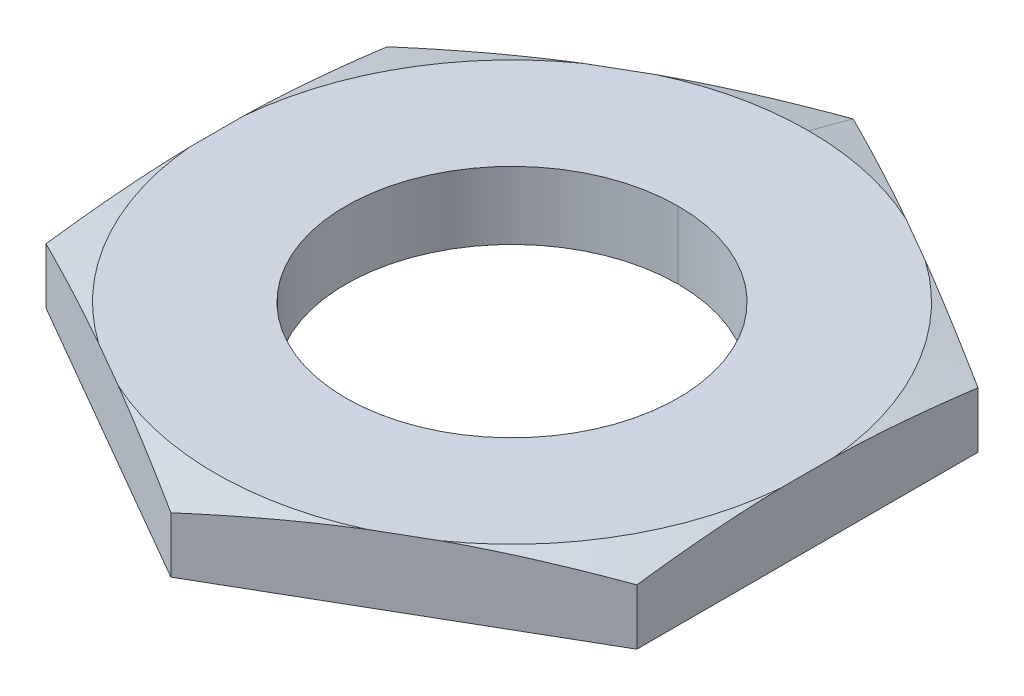
ISO-10303-21;
HEADER;
FILE_DESCRIPTION(('STEP AP214'),'2;1');
FILE_NAME('part.step','',(''),(''),'','','');
FILE_SCHEMA(('AUTOMOTIVE_DESIGN { 1 0 10303 214 1 1 1 1 }'));
ENDSEC;
DATA;
#1=APPLICATION_CONTEXT('core data for automotive mechanical design processes');
#2=APPLICATION_PROTOCOL_DEFINITION('international standard','automotive_design',2000,#1);
#3=PRODUCT_CONTEXT('',#1,'mechanical');
#4=PRODUCT('Part','Part','',(#3));
#5=PRODUCT_RELATED_PRODUCT_CATEGORY('part','',(#4));
#6=PRODUCT_DEFINITION_FORMATION('','',#4);
#7=PRODUCT_DEFINITION_CONTEXT('part definition',#1,'design');
#8=PRODUCT_DEFINITION('design','',#6,#7);
#9=PRODUCT_DEFINITION_SHAPE('','',#8);
#10=(LENGTH_UNIT() NAMED_UNIT(*) SI_UNIT(.MILLI.,.METRE.));
#11=(NAMED_UNIT(*) PLANE_ANGLE_UNIT() SI_UNIT($,.RADIAN.));
#12=(NAMED_UNIT(*) SI_UNIT($,.STERADIAN.) SOLID_ANGLE_UNIT());
#13=UNCERTAINTY_MEASURE_WITH_UNIT(LENGTH_MEASURE(1.E-05),#10,'distance_accuracy_value','');
#14=(GEOMETRIC_REPRESENTATION_CONTEXT(3) GLOBAL_UNCERTAINTY_ASSIGNED_CONTEXT((#13)) GLOBAL_UNIT_ASSIGNED_CONTEXT((#10,
#11,#12)) REPRESENTATION_CONTEXT('',''));
#15=CARTESIAN_POINT('',(0.,0.,0.));
#16=DIRECTION('',(0.,0.,1.));
#17=DIRECTION('',(1.,0.,0.));
#18=AXIS2_PLACEMENT_3D('',#15,#16,#17);
#19=CARTESIAN_POINT('',(0.,9.652,0.));
#20=DIRECTION('',(0.,-1.,0.));
#21=DIRECTION('',(0.,0.,-1.));
#22=AXIS2_PLACEMENT_3D('',#19,#20,#21);
#23=CONICAL_SURFACE('',#22,42.3367935002227,1.30899693899575);
#24=CARTESIAN_POINT('',(-24.3912130349041,9.652,34.6045200886595));
#25=CARTESIAN_POINT('',(-28.7258218424301,9.53095471923027,32.1019325268026));
#26=CARTESIAN_POINT('',(-33.2776065174521,9.08483123292887,29.4739584193855));
#27=CARTESIAN_POINT('',(-37.5185983773187,8.66916876007905,27.0254206274605));
#28=CARTESIAN_POINT('',(-42.164,7.95052262806242,24.3433967501115));
#29=B_SPLINE_CURVE_WITH_KNOTS('',2,(#24,#25,#26,#27,#28),.UNSPECIFIED.,.F.,.F.,(3,2,3),(0.,0.5,
1.),.UNSPECIFIED.);
#30=CARTESIAN_POINT('',(-24.3912130349039,9.652,34.6045200886594));
#31=VERTEX_POINT('',#30);
#32=CARTESIAN_POINT('',(-42.164,7.95052262806242,24.3433967501115));
#33=VERTEX_POINT('',#32);
#34=EDGE_CURVE('E388',#31,#33,#29,.T.);
#35=ORIENTED_EDGE('',*,*,#34,.F.);
#36=CARTESIAN_POINT('',(0.,9.652,0.));
#37=DIRECTION('',(0.,-1.,0.));
#38=DIRECTION('',(0.,0.,1.));
#39=AXIS2_PLACEMENT_3D('',#36,#37,#38);
#40=CIRCLE('',#39,42.3367935002227);
#41=CARTESIAN_POINT('',(-42.164,9.652,3.82115007301555));
#42=VERTEX_POINT('',#41);
#43=EDGE_CURVE('E500',#31,#42,#40,.T.);
#44=ORIENTED_EDGE('',*,*,#43,.T.);
#45=CARTESIAN_POINT('',(-42.1639999999998,7.95052262806242,24.3433967501116));
#46=CARTESIAN_POINT('',(-42.1639999999998,8.66908920542397,18.9799427994431));
#47=CARTESIAN_POINT('',(-42.1639999999999,9.08483123292888,14.0822734115636));
#48=CARTESIAN_POINT('',(-42.1639999999999,9.53094225490406,8.82684059175391));
#49=CARTESIAN_POINT('',(-42.1639999999999,9.652,3.82115007301555));
#50=B_SPLINE_CURVE_WITH_KNOTS('',2,(#45,#46,#47,#48,#49),.UNSPECIFIED.,.F.,.F.,(3,2,3),(0.,0.5,
1.),.UNSPECIFIED.);
#51=EDGE_CURVE('E561',#33,#42,#50,.T.);
#52=ORIENTED_EDGE('',*,*,#51,.F.);
#53=EDGE_LOOP('',(#35,#44,#52));
#54=FACE_BOUND('',#53,.T.);
#55=ADVANCED_FACE('F15',(#54),#23,.T.);
#56=CARTESIAN_POINT('',(0.,9.652,0.));
#57=DIRECTION('',(0.,-1.,0.));
#58=DIRECTION('',(0.,0.,-1.));
#59=AXIS2_PLACEMENT_3D('',#56,#57,#58);
#60=CONICAL_SURFACE('',#59,42.3367935002227,1.30899693899575);
#61=CARTESIAN_POINT('',(-42.1639999999999,9.652,-3.82115007301525));
#62=CARTESIAN_POINT('',(-42.1639999999999,9.53095471923389,-8.82632519657955));
#63=CARTESIAN_POINT('',(-42.164,9.08483123292888,-14.0822734115632));
#64=CARTESIAN_POINT('',(-42.164,8.66916876010212,-18.9793489952411));
#65=CARTESIAN_POINT('',(-42.164,7.95052262806242,-24.3433967501112));
#66=B_SPLINE_CURVE_WITH_KNOTS('',2,(#61,#62,#63,#64,#65),.UNSPECIFIED.,.F.,.F.,(3,2,3),(0.,0.5,
1.),.UNSPECIFIED.);
#67=CARTESIAN_POINT('',(-42.164,9.652,-3.82115007301525));
#68=VERTEX_POINT('',#67);
#69=CARTESIAN_POINT('',(-42.164,7.95052262806242,-24.3433967501112));
#70=VERTEX_POINT('',#69);
#71=EDGE_CURVE('E297',#68,#70,#66,.T.);
#72=ORIENTED_EDGE('',*,*,#71,.F.);
#73=CARTESIAN_POINT('',(0.,9.652,0.));
#74=DIRECTION('',(0.,-1.,0.));
#75=DIRECTION('',(0.,0.,1.));
#76=AXIS2_PLACEMENT_3D('',#73,#74,#75);
#77=CIRCLE('',#76,42.3367935002227);
#78=CARTESIAN_POINT('',(-24.3912130349042,9.652,-34.6045200886592));
#79=VERTEX_POINT('',#78);
#80=EDGE_CURVE('E176',#68,#79,#77,.T.);
#81=ORIENTED_EDGE('',*,*,#80,.T.);
#82=CARTESIAN_POINT('',(-42.164,7.95052262806242,-24.3433967501113));
#83=CARTESIAN_POINT('',(-37.5191126267838,8.66908920540993,-27.0251237253931));
#84=CARTESIAN_POINT('',(-33.2776065174521,9.08483123292887,-29.4739584193852));
#85=CARTESIAN_POINT('',(-28.7262681876932,9.53094225490186,-32.1016748292446));
#86=CARTESIAN_POINT('',(-24.3912130349042,9.652,-34.6045200886592));
#87=B_SPLINE_CURVE_WITH_KNOTS('',2,(#82,#83,#84,#85,#86),.UNSPECIFIED.,.F.,.F.,(3,2,3),(0.,0.5,
1.),.UNSPECIFIED.);
#88=EDGE_CURVE('E169',#70,#79,#87,.T.);
#89=ORIENTED_EDGE('',*,*,#88,.F.);
#90=EDGE_LOOP('',(#72,#81,#89));
#91=FACE_BOUND('',#90,.T.);
#92=ADVANCED_FACE('F259',(#91),#60,.T.);
#93=CARTESIAN_POINT('',(0.,9.652,0.));
#94=DIRECTION('',(0.,-1.,0.));
#95=DIRECTION('',(0.,0.,-1.));
#96=AXIS2_PLACEMENT_3D('',#93,#94,#95);
#97=CONICAL_SURFACE('',#96,42.3367935002227,1.30899693899575);
#98=DIRECTION('',(0.,-0.258819045102514,-0.96592582628907));
#99=VECTOR('',#98,1.);
#100=CARTESIAN_POINT('',(0.,9.652,-42.3367935002227));
#101=LINE('',#100,#99);
#102=CARTESIAN_POINT('',(0.,9.652,-42.3367935002227));
#103=VERTEX_POINT('',#102);
#104=CARTESIAN_POINT('',(0.,7.95052262806242,-48.6867935002227));
#105=VERTEX_POINT('',#104);
#106=EDGE_CURVE('E185',#103,#105,#101,.T.);
#107=ORIENTED_EDGE('',*,*,#106,.F.);
#108=CARTESIAN_POINT('',(0.,9.652,0.));
#109=DIRECTION('',(0.,-1.,0.));
#110=DIRECTION('',(0.,0.,1.));
#111=AXIS2_PLACEMENT_3D('',#108,#109,#110);
#112=CIRCLE('',#111,42.3367935002227);
#113=CARTESIAN_POINT('',(17.7727869650972,9.652,-38.425670161674));
#114=VERTEX_POINT('',#113);
#115=EDGE_CURVE('E177',#103,#114,#112,.T.);
#116=ORIENTED_EDGE('',*,*,#115,.T.);
#117=CARTESIAN_POINT('',(3.33066907387547E-13,7.95052262806242,-48.6867935002229));
#118=CARTESIAN_POINT('',(4.64488737321626,8.66908920540989,-46.0050665249412));
#119=CARTESIAN_POINT('',(8.88639348254892,9.08483123292892,-43.5562318309486));
#120=CARTESIAN_POINT('',(13.4377318123078,9.5309422549019,-40.9285154210893));
#121=CARTESIAN_POINT('',(17.7727869650976,9.652,-38.4256701616742));
#122=B_SPLINE_CURVE_WITH_KNOTS('',2,(#117,#118,#119,#120,#121),.UNSPECIFIED.,.F.,.F.,(3,2,3),
(0.,0.5,1.),.UNSPECIFIED.);
#123=EDGE_CURVE('E242',#105,#114,#122,.T.);
#124=ORIENTED_EDGE('',*,*,#123,.F.);
#125=EDGE_LOOP('',(#107,#116,#124));
#126=FACE_BOUND('',#125,.T.);
#127=ADVANCED_FACE('F249',(#126),#97,.T.);
#128=CARTESIAN_POINT('',(0.,9.652,0.));
#129=DIRECTION('',(0.,-1.,0.));
#130=DIRECTION('',(0.,0.,-1.));
#131=AXIS2_PLACEMENT_3D('',#128,#129,#130);
#132=CONICAL_SURFACE('',#131,42.3367935002227,1.30899693899575);
#133=CARTESIAN_POINT('',(0.,9.652,0.));
#134=DIRECTION('',(0.,-1.,0.));
#135=DIRECTION('',(0.,0.,1.));
#136=AXIS2_PLACEMENT_3D('',#133,#134,#135);
#137=CIRCLE('',#136,42.3367935002227);
#138=CARTESIAN_POINT('',(24.3912130349024,9.652,-34.6045200886604));
#139=VERTEX_POINT('',#138);
#140=CARTESIAN_POINT('',(42.164,9.652,-3.82115007301592));
#141=VERTEX_POINT('',#140);
#142=EDGE_CURVE('E448',#139,#141,#137,.T.);
#143=ORIENTED_EDGE('',*,*,#142,.T.);
#144=CARTESIAN_POINT('',(42.1639999999995,7.95052262806242,-24.3433967501119));
#145=CARTESIAN_POINT('',(42.1639999999995,8.66908920540271,-18.979942799602));
#146=CARTESIAN_POINT('',(42.1639999999996,9.08483123292888,-14.0822734115639));
#147=CARTESIAN_POINT('',(42.1639999999997,9.53094225490073,-8.82684059189195));
#148=CARTESIAN_POINT('',(42.1639999999997,9.652,-3.82115007301595));
#149=B_SPLINE_CURVE_WITH_KNOTS('',2,(#144,#145,#146,#147,#148),.UNSPECIFIED.,.F.,.F.,(3,2,3),
(0.,0.5,1.),.UNSPECIFIED.);
#150=CARTESIAN_POINT('',(42.164,7.95052262806242,-24.3433967501118));
#151=VERTEX_POINT('',#150);
#152=EDGE_CURVE('E392',#151,#141,#149,.T.);
#153=ORIENTED_EDGE('',*,*,#152,.F.);
#154=CARTESIAN_POINT('',(24.3912130349028,9.652,-34.6045200886606));
#155=CARTESIAN_POINT('',(28.7258218422821,9.53095471923442,-32.1019325268884));
#156=CARTESIAN_POINT('',(33.2776065174513,9.08483123292893,-29.4739584193862));
#157=CARTESIAN_POINT('',(37.5185983771489,8.66916876010531,-27.0254206275588));
#158=CARTESIAN_POINT('',(42.164,7.95052262806242,-24.3433967501118));
#159=B_SPLINE_CURVE_WITH_KNOTS('',2,(#154,#155,#156,#157,#158),.UNSPECIFIED.,.F.,.F.,(3,2,3),
(0.,0.5,1.),.UNSPECIFIED.);
#160=EDGE_CURVE('E339',#139,#151,#159,.T.);
#161=ORIENTED_EDGE('',*,*,#160,.F.);
#162=EDGE_LOOP('',(#143,#153,#161));
#163=FACE_BOUND('',#162,.T.);
#164=ADVANCED_FACE('F258',(#163),#132,.T.);
#165=CARTESIAN_POINT('',(0.,9.652,0.));
#166=DIRECTION('',(0.,-1.,0.));
#167=DIRECTION('',(0.,0.,-1.));
#168=AXIS2_PLACEMENT_3D('',#165,#166,#167);
#169=CONICAL_SURFACE('',#168,42.3367935002227,1.30899693899575);
#170=CARTESIAN_POINT('',(42.1639999999998,9.652,3.82115007301505));
#171=CARTESIAN_POINT('',(42.1639999999998,9.53095471923389,8.82632519657925));
#172=CARTESIAN_POINT('',(42.1639999999999,9.08483123292888,14.082273411563));
#173=CARTESIAN_POINT('',(42.1639999999999,8.66916876010213,18.9793489952407));
#174=CARTESIAN_POINT('',(42.164,7.95052262806242,24.343396750111));
#175=B_SPLINE_CURVE_WITH_KNOTS('',2,(#170,#171,#172,#173,#174),.UNSPECIFIED.,.F.,.F.,(3,2,3),
(0.,0.5,1.),.UNSPECIFIED.);
#176=CARTESIAN_POINT('',(42.164,9.652,3.82115007301504));
#177=VERTEX_POINT('',#176);
#178=CARTESIAN_POINT('',(42.164,7.95052262806242,24.3433967501109));
#179=VERTEX_POINT('',#178);
#180=EDGE_CURVE('E49',#177,#179,#175,.T.);
#181=ORIENTED_EDGE('',*,*,#180,.F.);
#182=CARTESIAN_POINT('',(0.,9.652,0.));
#183=DIRECTION('',(0.,-1.,0.));
#184=DIRECTION('',(0.,0.,1.));
#185=AXIS2_PLACEMENT_3D('',#182,#183,#184);
#186=CIRCLE('',#185,42.3367935002227);
#187=CARTESIAN_POINT('',(24.3912130349045,9.652,34.604520088659));
#188=VERTEX_POINT('',#187);
#189=EDGE_CURVE('E461',#177,#188,#186,.T.);
#190=ORIENTED_EDGE('',*,*,#189,.T.);
#191=CARTESIAN_POINT('',(42.1640000000002,7.95052262806241,24.343396750111));
#192=CARTESIAN_POINT('',(37.5191126271523,8.66908920535296,27.0251237251802));
#193=CARTESIAN_POINT('',(33.2776065174524,9.08483123292888,29.473958419385));
#194=CARTESIAN_POINT('',(28.7262681880131,9.53094225489294,32.1016748290598));
#195=CARTESIAN_POINT('',(24.3912130349045,9.652,34.604520088659));
#196=B_SPLINE_CURVE_WITH_KNOTS('',2,(#191,#192,#193,#194,#195),.UNSPECIFIED.,.F.,.F.,(3,2,3),
(0.,0.5,1.),.UNSPECIFIED.);
#197=EDGE_CURVE('E485',#179,#188,#196,.T.);
#198=ORIENTED_EDGE('',*,*,#197,.F.);
#199=EDGE_LOOP('',(#181,#190,#198));
#200=FACE_BOUND('',#199,.T.);
#201=ADVANCED_FACE('F270',(#200),#169,.T.);
#202=CARTESIAN_POINT('',(0.,9.652,0.));
#203=DIRECTION('',(0.,-1.,0.));
#204=DIRECTION('',(0.,0.,-1.));
#205=AXIS2_PLACEMENT_3D('',#202,#203,#204);
#206=CONICAL_SURFACE('',#205,42.3367935002227,1.30899693899575);
#207=CARTESIAN_POINT('',(17.7727869650961,9.652,38.4256701616746));
#208=CARTESIAN_POINT('',(13.4381781575699,9.53095471923026,40.9282577235316));
#209=CARTESIAN_POINT('',(8.88639348254817,9.08483123292888,43.5562318309487));
#210=CARTESIAN_POINT('',(4.64540162268181,8.66916876007908,46.0047696228736));
#211=CARTESIAN_POINT('',(3.27231216561469E-13,7.95052262806241,48.6867935002227));
#212=B_SPLINE_CURVE_WITH_KNOTS('',2,(#207,#208,#209,#210,#211),.UNSPECIFIED.,.F.,.F.,(3,2,3),
(0.,0.5,1.),.UNSPECIFIED.);
#213=CARTESIAN_POINT('',(17.772786965096,9.652,38.4256701616747));
#214=VERTEX_POINT('',#213);
#215=CARTESIAN_POINT('',(3.22658566531686E-13,7.95052262806242,48.6867935002227));
#216=VERTEX_POINT('',#215);
#217=EDGE_CURVE('E393',#214,#216,#212,.T.);
#218=ORIENTED_EDGE('',*,*,#217,.F.);
#219=CARTESIAN_POINT('',(0.,9.652,0.));
#220=DIRECTION('',(0.,-1.,0.));
#221=DIRECTION('',(0.,0.,1.));
#222=AXIS2_PLACEMENT_3D('',#219,#220,#221);
#223=CIRCLE('',#222,42.3367935002227);
#224=CARTESIAN_POINT('',(-17.7727869650955,9.652,38.4256701616749));
#225=VERTEX_POINT('',#224);
#226=EDGE_CURVE('E480',#214,#225,#223,.T.);
#227=ORIENTED_EDGE('',*,*,#226,.T.);
#228=CARTESIAN_POINT('',(1.94289029309402E-13,7.95052262806242,48.686793500223));
#229=CARTESIAN_POINT('',(-4.6448873733068,8.66908920542398,46.0050665248887));
#230=CARTESIAN_POINT('',(-8.88639348254775,9.08483123292887,43.556231830949));
#231=CARTESIAN_POINT('',(-13.4377318123855,9.53094225490406,40.9285154210441));
#232=CARTESIAN_POINT('',(-17.7727869650957,9.652,38.425670161675));
#233=B_SPLINE_CURVE_WITH_KNOTS('',2,(#228,#229,#230,#231,#232),.UNSPECIFIED.,.F.,.F.,(3,2,3),
(0.,0.5,1.),.UNSPECIFIED.);
#234=EDGE_CURVE('E482',#216,#225,#233,.T.);
#235=ORIENTED_EDGE('',*,*,#234,.F.);
#236=EDGE_LOOP('',(#218,#227,#235));
#237=FACE_BOUND('',#236,.T.);
#238=ADVANCED_FACE('F266',(#237),#206,.T.);
#239=CARTESIAN_POINT('',(0.,0.,0.));
#240=DIRECTION('',(0.,1.,0.));
#241=DIRECTION('',(0.,0.,1.));
#242=AXIS2_PLACEMENT_3D('',#239,#240,#241);
#243=CYLINDRICAL_SURFACE('',#242,23.7236);
#244=DIRECTION('',(0.,1.,0.));
#245=VECTOR('',#244,1.);
#246=CARTESIAN_POINT('',(0.,0.,-23.7236));
#247=LINE('',#246,#245);
#248=CARTESIAN_POINT('',(0.,0.,-23.7236));
#249=VERTEX_POINT('',#248);
#250=CARTESIAN_POINT('',(0.,9.652,-23.7236));
#251=VERTEX_POINT('',#250);
#252=EDGE_CURVE('E942',#249,#251,#247,.T.);
#253=ORIENTED_EDGE('',*,*,#252,.F.);
#254=CARTESIAN_POINT('',(0.,0.,0.));
#255=DIRECTION('',(0.,1.,0.));
#256=DIRECTION('',(0.,0.,1.));
#257=AXIS2_PLACEMENT_3D('',#254,#255,#256);
#258=CIRCLE('',#257,23.7236);
#259=CARTESIAN_POINT('',(0.,0.,23.7236));
#260=VERTEX_POINT('',#259);
#261=EDGE_CURVE('E9',#260,#249,#258,.T.);
#262=ORIENTED_EDGE('',*,*,#261,.F.);
#263=DIRECTION('',(0.,1.,0.));
#264=VECTOR('',#263,1.);
#265=CARTESIAN_POINT('',(0.,0.,23.7236));
#266=LINE('',#265,#264);
#267=CARTESIAN_POINT('',(0.,9.652,23.7236));
#268=VERTEX_POINT('',#267);
#269=EDGE_CURVE('E556',#260,#268,#266,.T.);
#270=ORIENTED_EDGE('',*,*,#269,.T.);
#271=CARTESIAN_POINT('',(0.,9.652,0.));
#272=DIRECTION('',(0.,1.,0.));
#273=DIRECTION('',(0.,0.,1.));
#274=AXIS2_PLACEMENT_3D('',#271,#272,#273);
#275=CIRCLE('',#274,23.7236);
#276=EDGE_CURVE('E357',#268,#251,#275,.T.);
#277=ORIENTED_EDGE('',*,*,#276,.T.);
#278=EDGE_LOOP('',(#253,#262,#270,#277));
#279=FACE_BOUND('',#278,.T.);
#280=ADVANCED_FACE('F264',(#279),#243,.F.);
#281=CARTESIAN_POINT('',(0.,0.,0.));
#282=DIRECTION('',(0.,1.,0.));
#283=DIRECTION('',(1.,0.,0.));
#284=AXIS2_PLACEMENT_3D('',#281,#282,#283);
#285=PLANE('',#284);
#286=ORIENTED_EDGE('',*,*,#261,.T.);
#287=CARTESIAN_POINT('',(0.,0.,0.));
#288=DIRECTION('',(0.,1.,0.));
#289=DIRECTION('',(0.,0.,1.));
#290=AXIS2_PLACEMENT_3D('',#287,#288,#289);
#291=CIRCLE('',#290,23.7236);
#292=EDGE_CURVE('E187',#249,#260,#291,.T.);
#293=ORIENTED_EDGE('',*,*,#292,.T.);
#294=EDGE_LOOP('',(#286,#293));
#295=FACE_BOUND('',#294,.T.);
#296=DIRECTION('',(-0.866025403784442,0.,-0.5));
#297=VECTOR('',#296,1.);
#298=CARTESIAN_POINT('',(42.164,0.,-24.3433967501118));
#299=LINE('',#298,#297);
#300=CARTESIAN_POINT('',(42.164,0.,-24.3433967501118));
#301=VERTEX_POINT('',#300);
#302=CARTESIAN_POINT('',(0.,0.,-48.6867935002227));
#303=VERTEX_POINT('',#302);
#304=EDGE_CURVE('E352',#301,#303,#299,.T.);
#305=ORIENTED_EDGE('',*,*,#304,.F.);
#306=DIRECTION('',(0.,0.,-1.));
#307=VECTOR('',#306,1.);
#308=CARTESIAN_POINT('',(42.164,0.,24.3433967501109));
#309=LINE('',#308,#307);
#310=CARTESIAN_POINT('',(42.164,0.,24.3433967501109));
#311=VERTEX_POINT('',#310);
#312=EDGE_CURVE('E25',#311,#301,#309,.T.);
#313=ORIENTED_EDGE('',*,*,#312,.F.);
#314=DIRECTION('',(0.866025403784435,0.,-0.500000000000007));
#315=VECTOR('',#314,1.);
#316=CARTESIAN_POINT('',(3.39978061908274E-13,0.,48.6867935002227));
#317=LINE('',#316,#315);
#318=CARTESIAN_POINT('',(3.39978061908274E-13,0.,48.6867935002227));
#319=VERTEX_POINT('',#318);
#320=EDGE_CURVE('E389',#319,#311,#317,.T.);
#321=ORIENTED_EDGE('',*,*,#320,.F.);
#322=DIRECTION('',(0.866025403784442,0.,0.5));
#323=VECTOR('',#322,1.);
#324=CARTESIAN_POINT('',(-42.164,0.,24.3433967501115));
#325=LINE('',#324,#323);
#326=CARTESIAN_POINT('',(-42.164,0.,24.3433967501115));
#327=VERTEX_POINT('',#326);
#328=EDGE_CURVE('E383',#327,#319,#325,.T.);
#329=ORIENTED_EDGE('',*,*,#328,.F.);
#330=DIRECTION('',(0.,0.,1.));
#331=VECTOR('',#330,1.);
#332=CARTESIAN_POINT('',(-42.164,0.,-24.3433967501112));
#333=LINE('',#332,#331);
#334=CARTESIAN_POINT('',(-42.164,0.,-24.3433967501112));
#335=VERTEX_POINT('',#334);
#336=EDGE_CURVE('E378',#335,#327,#333,.T.);
#337=ORIENTED_EDGE('',*,*,#336,.F.);
#338=DIRECTION('',(-0.866025403784438,0.,0.5));
#339=VECTOR('',#338,1.);
#340=CARTESIAN_POINT('',(0.,0.,-48.6867935002227));
#341=LINE('',#340,#339);
#342=EDGE_CURVE('E374',#303,#335,#341,.T.);
#343=ORIENTED_EDGE('',*,*,#342,.F.);
#344=EDGE_LOOP('',(#305,#313,#321,#329,#337,#343));
#345=FACE_BOUND('',#344,.T.);
#346=ADVANCED_FACE('F260',(#295,#345),#285,.F.);
#347=CARTESIAN_POINT('',(42.164,9.652,24.3433967501109));
#348=DIRECTION('',(-1.,0.,0.));
#349=DIRECTION('',(0.,1.,0.));
#350=AXIS2_PLACEMENT_3D('',#347,#348,#349);
#351=PLANE('',#350);
#352=DIRECTION('',(0.,-1.,0.));
#353=VECTOR('',#352,1.);
#354=CARTESIAN_POINT('',(42.164,9.652,-24.3433967501118));
#355=LINE('',#354,#353);
#356=EDGE_CURVE('E342',#151,#301,#355,.T.);
#357=ORIENTED_EDGE('',*,*,#356,.F.);
#358=ORIENTED_EDGE('',*,*,#152,.T.);
#359=DIRECTION('',(0.,0.,-1.));
#360=VECTOR('',#359,1.);
#361=CARTESIAN_POINT('',(42.164,9.652,24.3433967501109));
#362=LINE('',#361,#360);
#363=EDGE_CURVE('E454',#177,#141,#362,.T.);
#364=ORIENTED_EDGE('',*,*,#363,.F.);
#365=ORIENTED_EDGE('',*,*,#180,.T.);
#366=DIRECTION('',(0.,-1.,0.));
#367=VECTOR('',#366,1.);
#368=CARTESIAN_POINT('',(42.164,9.652,24.3433967501109));
#369=LINE('',#368,#367);
#370=EDGE_CURVE('E387',#179,#311,#369,.T.);
#371=ORIENTED_EDGE('',*,*,#370,.T.);
#372=ORIENTED_EDGE('',*,*,#312,.T.);
#373=EDGE_LOOP('',(#357,#358,#364,#365,#371,#372));
#374=FACE_BOUND('',#373,.T.);
#375=ADVANCED_FACE('F263',(#374),#351,.F.);
#376=CARTESIAN_POINT('',(3.39978061908274E-13,9.652,48.6867935002227));
#377=DIRECTION('',(-0.500000000000007,0.,-0.866025403784435));
#378=DIRECTION('',(-0.866025403784435,0.,0.500000000000007));
#379=AXIS2_PLACEMENT_3D('',#376,#377,#378);
#380=PLANE('',#379);
#381=ORIENTED_EDGE('',*,*,#370,.F.);
#382=ORIENTED_EDGE('',*,*,#197,.T.);
#383=DIRECTION('',(0.866025403784435,0.,-0.500000000000007));
#384=VECTOR('',#383,1.);
#385=CARTESIAN_POINT('',(3.39978061908274E-13,9.652,48.6867935002227));
#386=LINE('',#385,#384);
#387=EDGE_CURVE('E487',#214,#188,#386,.T.);
#388=ORIENTED_EDGE('',*,*,#387,.F.);
#389=ORIENTED_EDGE('',*,*,#217,.T.);
#390=DIRECTION('',(0.,-1.,0.));
#391=VECTOR('',#390,1.);
#392=CARTESIAN_POINT('',(3.39978061908274E-13,9.652,48.6867935002227));
#393=LINE('',#392,#391);
#394=EDGE_CURVE('E382',#216,#319,#393,.T.);
#395=ORIENTED_EDGE('',*,*,#394,.T.);
#396=ORIENTED_EDGE('',*,*,#320,.T.);
#397=EDGE_LOOP('',(#381,#382,#388,#389,#395,#396));
#398=FACE_BOUND('',#397,.T.);
#399=ADVANCED_FACE('F409',(#398),#380,.F.);
#400=CARTESIAN_POINT('',(-42.164,9.652,24.3433967501115));
#401=DIRECTION('',(0.5,0.,-0.866025403784442));
#402=DIRECTION('',(0.,-1.,0.));
#403=AXIS2_PLACEMENT_3D('',#400,#401,#402);
#404=PLANE('',#403);
#405=ORIENTED_EDGE('',*,*,#394,.F.);
#406=ORIENTED_EDGE('',*,*,#234,.T.);
#407=DIRECTION('',(0.866025403784442,0.,0.5));
#408=VECTOR('',#407,1.);
#409=CARTESIAN_POINT('',(-42.164,9.652,24.3433967501115));
#410=LINE('',#409,#408);
#411=EDGE_CURVE('E494',#31,#225,#410,.T.);
#412=ORIENTED_EDGE('',*,*,#411,.F.);
#413=ORIENTED_EDGE('',*,*,#34,.T.);
#414=DIRECTION('',(0.,-1.,0.));
#415=VECTOR('',#414,1.);
#416=CARTESIAN_POINT('',(-42.164,9.652,24.3433967501115));
#417=LINE('',#416,#415);
#418=EDGE_CURVE('E377',#33,#327,#417,.T.);
#419=ORIENTED_EDGE('',*,*,#418,.T.);
#420=ORIENTED_EDGE('',*,*,#328,.T.);
#421=EDGE_LOOP('',(#405,#406,#412,#413,#419,#420));
#422=FACE_BOUND('',#421,.T.);
#423=ADVANCED_FACE('F435',(#422),#404,.F.);
#424=CARTESIAN_POINT('',(-42.164,9.652,-24.3433967501112));
#425=DIRECTION('',(1.,0.,0.));
#426=DIRECTION('',(0.,0.,-1.));
#427=AXIS2_PLACEMENT_3D('',#424,#425,#426);
#428=PLANE('',#427);
#429=ORIENTED_EDGE('',*,*,#418,.F.);
#430=ORIENTED_EDGE('',*,*,#51,.T.);
#431=DIRECTION('',(0.,0.,1.));
#432=VECTOR('',#431,1.);
#433=CARTESIAN_POINT('',(-42.164,9.652,-24.3433967501112));
#434=LINE('',#433,#432);
#435=EDGE_CURVE('E311',#68,#42,#434,.T.);
#436=ORIENTED_EDGE('',*,*,#435,.F.);
#437=ORIENTED_EDGE('',*,*,#71,.T.);
#438=DIRECTION('',(0.,-1.,0.));
#439=VECTOR('',#438,1.);
#440=CARTESIAN_POINT('',(-42.164,9.652,-24.3433967501112));
#441=LINE('',#440,#439);
#442=EDGE_CURVE('E936',#70,#335,#441,.T.);
#443=ORIENTED_EDGE('',*,*,#442,.T.);
#444=ORIENTED_EDGE('',*,*,#336,.T.);
#445=EDGE_LOOP('',(#429,#430,#436,#437,#443,#444));
#446=FACE_BOUND('',#445,.T.);
#447=ADVANCED_FACE('F272',(#446),#428,.F.);
#448=CARTESIAN_POINT('',(0.,9.652,-48.6867935002227));
#449=DIRECTION('',(0.5,0.,0.866025403784438));
#450=DIRECTION('',(0.,-1.,0.));
#451=AXIS2_PLACEMENT_3D('',#448,#449,#450);
#452=PLANE('',#451);
#453=ORIENTED_EDGE('',*,*,#442,.F.);
#454=ORIENTED_EDGE('',*,*,#88,.T.);
#455=DIRECTION('',(-0.866025403784438,0.,0.5));
#456=VECTOR('',#455,1.);
#457=CARTESIAN_POINT('',(0.,9.652,-48.6867935002227));
#458=LINE('',#457,#456);
#459=CARTESIAN_POINT('',(-17.7727869650957,9.652,-38.4256701616748));
#460=VERTEX_POINT('',#459);
#461=EDGE_CURVE('E160',#460,#79,#458,.T.);
#462=ORIENTED_EDGE('',*,*,#461,.F.);
#463=CARTESIAN_POINT('',(-17.7727869650958,9.652,-38.4256701616748));
#464=CARTESIAN_POINT('',(-13.4381781577679,9.53095471923579,-40.9282577234173));
#465=CARTESIAN_POINT('',(-8.88639348254788,9.08483123292887,-43.5562318309487));
#466=CARTESIAN_POINT('',(-4.64540162290958,8.66916876011437,-46.0047696227419));
#467=CARTESIAN_POINT('',(0.,7.95052262806242,-48.6867935002227));
#468=B_SPLINE_CURVE_WITH_KNOTS('',2,(#463,#464,#465,#466,#467),.UNSPECIFIED.,.F.,.F.,(3,2,3),
(0.,0.5,1.),.UNSPECIFIED.);
#469=EDGE_CURVE('E165',#460,#105,#468,.T.);
#470=ORIENTED_EDGE('',*,*,#469,.T.);
#471=DIRECTION('',(0.,-1.,0.));
#472=VECTOR('',#471,1.);
#473=CARTESIAN_POINT('',(0.,9.652,-48.6867935002227));
#474=LINE('',#473,#472);
#475=EDGE_CURVE('E247',#105,#303,#474,.T.);
#476=ORIENTED_EDGE('',*,*,#475,.T.);
#477=ORIENTED_EDGE('',*,*,#342,.T.);
#478=EDGE_LOOP('',(#453,#454,#462,#470,#476,#477));
#479=FACE_BOUND('',#478,.T.);
#480=ADVANCED_FACE('F163',(#479),#452,.F.);
#481=CARTESIAN_POINT('',(42.164,9.652,-24.3433967501118));
#482=DIRECTION('',(-0.5,0.,0.866025403784442));
#483=DIRECTION('',(0.,1.,0.));
#484=AXIS2_PLACEMENT_3D('',#481,#482,#483);
#485=PLANE('',#484);
#486=ORIENTED_EDGE('',*,*,#475,.F.);
#487=ORIENTED_EDGE('',*,*,#123,.T.);
#488=DIRECTION('',(-0.866025403784442,0.,-0.5));
#489=VECTOR('',#488,1.);
#490=CARTESIAN_POINT('',(42.164,9.652,-24.3433967501118));
#491=LINE('',#490,#489);
#492=EDGE_CURVE('E343',#139,#114,#491,.T.);
#493=ORIENTED_EDGE('',*,*,#492,.F.);
#494=ORIENTED_EDGE('',*,*,#160,.T.);
#495=ORIENTED_EDGE('',*,*,#356,.T.);
#496=ORIENTED_EDGE('',*,*,#304,.T.);
#497=EDGE_LOOP('',(#486,#487,#493,#494,#495,#496));
#498=FACE_BOUND('',#497,.T.);
#499=ADVANCED_FACE('F216',(#498),#485,.F.);
#500=CARTESIAN_POINT('',(0.,9.652,0.));
#501=DIRECTION('',(0.,1.,0.));
#502=DIRECTION('',(1.,0.,0.));
#503=AXIS2_PLACEMENT_3D('',#500,#501,#502);
#504=PLANE('',#503);
#505=ORIENTED_EDGE('',*,*,#276,.F.);
#506=CARTESIAN_POINT('',(0.,9.652,0.));
#507=DIRECTION('',(0.,1.,0.));
#508=DIRECTION('',(0.,0.,1.));
#509=AXIS2_PLACEMENT_3D('',#506,#507,#508);
#510=CIRCLE('',#509,23.7236);
#511=EDGE_CURVE('E931',#251,#268,#510,.T.);
#512=ORIENTED_EDGE('',*,*,#511,.F.);
#513=EDGE_LOOP('',(#505,#512));
#514=FACE_BOUND('',#513,.T.);
#515=ORIENTED_EDGE('',*,*,#43,.F.);
#516=ORIENTED_EDGE('',*,*,#411,.T.);
#517=ORIENTED_EDGE('',*,*,#226,.F.);
#518=ORIENTED_EDGE('',*,*,#387,.T.);
#519=ORIENTED_EDGE('',*,*,#189,.F.);
#520=ORIENTED_EDGE('',*,*,#363,.T.);
#521=ORIENTED_EDGE('',*,*,#142,.F.);
#522=ORIENTED_EDGE('',*,*,#492,.T.);
#523=ORIENTED_EDGE('',*,*,#115,.F.);
#524=CARTESIAN_POINT('',(0.,9.652,0.));
#525=DIRECTION('',(0.,-1.,0.));
#526=DIRECTION('',(0.,0.,1.));
#527=AXIS2_PLACEMENT_3D('',#524,#525,#526);
#528=CIRCLE('',#527,42.3367935002227);
#529=EDGE_CURVE('E183',#460,#103,#528,.T.);
#530=ORIENTED_EDGE('',*,*,#529,.F.);
#531=ORIENTED_EDGE('',*,*,#461,.T.);
#532=ORIENTED_EDGE('',*,*,#80,.F.);
#533=ORIENTED_EDGE('',*,*,#435,.T.);
#534=EDGE_LOOP('',(#515,#516,#517,#518,#519,#520,#521,#522,#523,#530,#531,#532,#533));
#535=FACE_BOUND('',#534,.T.);
#536=ADVANCED_FACE('F191',(#514,#535),#504,.T.);
#537=CARTESIAN_POINT('',(0.,0.,0.));
#538=DIRECTION('',(0.,1.,0.));
#539=DIRECTION('',(0.,0.,1.));
#540=AXIS2_PLACEMENT_3D('',#537,#538,#539);
#541=CYLINDRICAL_SURFACE('',#540,23.7236);
#542=ORIENTED_EDGE('',*,*,#292,.F.);
#543=ORIENTED_EDGE('',*,*,#252,.T.);
#544=ORIENTED_EDGE('',*,*,#511,.T.);
#545=ORIENTED_EDGE('',*,*,#269,.F.);
#546=EDGE_LOOP('',(#542,#543,#544,#545));
#547=FACE_BOUND('',#546,.T.);
#548=ADVANCED_FACE('F212',(#547),#541,.F.);
#549=CARTESIAN_POINT('',(0.,9.652,0.));
#550=DIRECTION('',(0.,-1.,0.));
#551=DIRECTION('',(0.,0.,-1.));
#552=AXIS2_PLACEMENT_3D('',#549,#550,#551);
#553=CONICAL_SURFACE('',#552,42.3367935002227,1.30899693899575);
#554=ORIENTED_EDGE('',*,*,#529,.T.);
#555=ORIENTED_EDGE('',*,*,#106,.T.);
#556=ORIENTED_EDGE('',*,*,#469,.F.);
#557=EDGE_LOOP('',(#554,#555,#556));
#558=FACE_BOUND('',#557,.T.);
#559=ADVANCED_FACE('F182',(#558),#553,.T.);
#560=CLOSED_SHELL('',(#55,#92,#127,#164,#201,#238,#280,#346,#375,#399,#423,#447,#480,#499,#536,
#548,#559));
#561=MANIFOLD_SOLID_BREP('B1',#560);
#562=ADVANCED_BREP_SHAPE_REPRESENTATION('',(#18,#561),#14);
#563=SHAPE_DEFINITION_REPRESENTATION(#9,#562);
ENDSEC;
END-ISO-10303-21;
